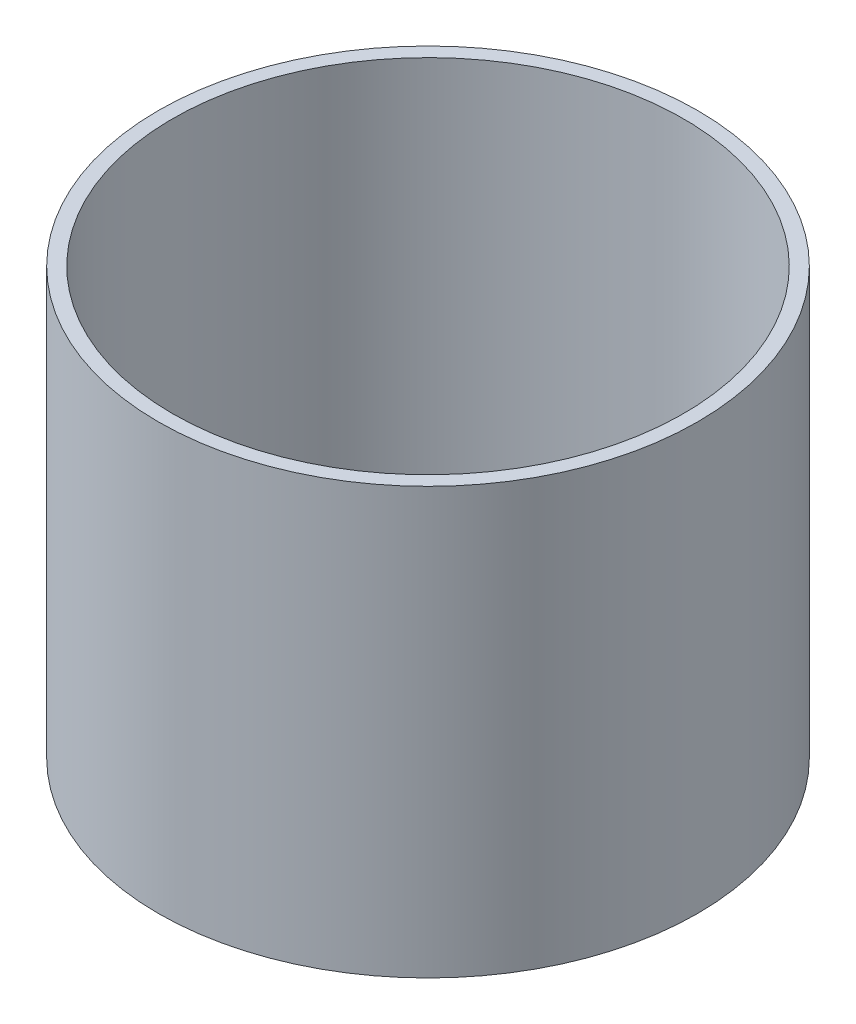
ISO-10303-21;
HEADER;
FILE_DESCRIPTION(('STEP AP214'),'2;1');
FILE_NAME('part.step','',(''),(''),'','','');
FILE_SCHEMA(('AUTOMOTIVE_DESIGN { 1 0 10303 214 1 1 1 1 }'));
ENDSEC;
DATA;
#1=APPLICATION_CONTEXT('core data for automotive mechanical design processes');
#2=APPLICATION_PROTOCOL_DEFINITION('international standard','automotive_design',2000,#1);
#3=PRODUCT_CONTEXT('',#1,'mechanical');
#4=PRODUCT('Part','Part','',(#3));
#5=PRODUCT_RELATED_PRODUCT_CATEGORY('part','',(#4));
#6=PRODUCT_DEFINITION_FORMATION('','',#4);
#7=PRODUCT_DEFINITION_CONTEXT('part definition',#1,'design');
#8=PRODUCT_DEFINITION('design','',#6,#7);
#9=PRODUCT_DEFINITION_SHAPE('','',#8);
#10=(LENGTH_UNIT() NAMED_UNIT(*) SI_UNIT(.MILLI.,.METRE.));
#11=(NAMED_UNIT(*) PLANE_ANGLE_UNIT() SI_UNIT($,.RADIAN.));
#12=(NAMED_UNIT(*) SI_UNIT($,.STERADIAN.) SOLID_ANGLE_UNIT());
#13=UNCERTAINTY_MEASURE_WITH_UNIT(LENGTH_MEASURE(1.E-05),#10,'distance_accuracy_value','');
#14=(GEOMETRIC_REPRESENTATION_CONTEXT(3) GLOBAL_UNCERTAINTY_ASSIGNED_CONTEXT((#13)) GLOBAL_UNIT_ASSIGNED_CONTEXT((#10,
#11,#12)) REPRESENTATION_CONTEXT('',''));
#15=CARTESIAN_POINT('',(0.,0.,0.));
#16=DIRECTION('',(0.,0.,1.));
#17=DIRECTION('',(1.,0.,0.));
#18=AXIS2_PLACEMENT_3D('',#15,#16,#17);
#19=CARTESIAN_POINT('',(0.,150.,0.));
#20=DIRECTION('',(0.,1.,0.));
#21=DIRECTION('',(0.,0.,1.));
#22=AXIS2_PLACEMENT_3D('',#19,#20,#21);
#23=PLANE('',#22);
#24=CARTESIAN_POINT('',(0.,150.,0.));
#25=DIRECTION('',(0.,1.,0.));
#26=DIRECTION('',(0.,0.,1.));
#27=AXIS2_PLACEMENT_3D('',#24,#25,#26);
#28=CIRCLE('',#27,95.);
#29=CARTESIAN_POINT('',(0.,150.,95.));
#30=VERTEX_POINT('',#29);
#31=EDGE_CURVE('E10',#30,#30,#28,.T.);
#32=ORIENTED_EDGE('',*,*,#31,.T.);
#33=EDGE_LOOP('',(#32));
#34=FACE_BOUND('',#33,.T.);
#35=CARTESIAN_POINT('',(0.,150.,0.));
#36=DIRECTION('',(0.,1.,0.));
#37=DIRECTION('',(0.,0.,1.));
#38=AXIS2_PLACEMENT_3D('',#35,#36,#37);
#39=CIRCLE('',#38,90.);
#40=CARTESIAN_POINT('',(0.,150.,90.));
#41=VERTEX_POINT('',#40);
#42=EDGE_CURVE('E42',#41,#41,#39,.T.);
#43=ORIENTED_EDGE('',*,*,#42,.F.);
#44=EDGE_LOOP('',(#43));
#45=FACE_BOUND('',#44,.T.);
#46=ADVANCED_FACE('F31',(#34,#45),#23,.T.);
#47=CARTESIAN_POINT('',(0.,0.,0.));
#48=DIRECTION('',(0.,1.,0.));
#49=DIRECTION('',(0.,0.,1.));
#50=AXIS2_PLACEMENT_3D('',#47,#48,#49);
#51=PLANE('',#50);
#52=CARTESIAN_POINT('',(0.,0.,0.));
#53=DIRECTION('',(0.,1.,0.));
#54=DIRECTION('',(0.,0.,1.));
#55=AXIS2_PLACEMENT_3D('',#52,#53,#54);
#56=CIRCLE('',#55,95.);
#57=CARTESIAN_POINT('',(0.,0.,95.));
#58=VERTEX_POINT('',#57);
#59=EDGE_CURVE('E35',#58,#58,#56,.T.);
#60=ORIENTED_EDGE('',*,*,#59,.F.);
#61=EDGE_LOOP('',(#60));
#62=FACE_BOUND('',#61,.T.);
#63=CARTESIAN_POINT('',(0.,0.,0.));
#64=DIRECTION('',(0.,1.,0.));
#65=DIRECTION('',(0.,0.,1.));
#66=AXIS2_PLACEMENT_3D('',#63,#64,#65);
#67=CIRCLE('',#66,90.);
#68=CARTESIAN_POINT('',(0.,0.,90.));
#69=VERTEX_POINT('',#68);
#70=EDGE_CURVE('E44',#69,#69,#67,.T.);
#71=ORIENTED_EDGE('',*,*,#70,.T.);
#72=EDGE_LOOP('',(#71));
#73=FACE_BOUND('',#72,.T.);
#74=ADVANCED_FACE('F54',(#62,#73),#51,.F.);
#75=CARTESIAN_POINT('',(0.,150.,0.));
#76=DIRECTION('',(0.,-1.,0.));
#77=DIRECTION('',(0.,0.,-1.));
#78=AXIS2_PLACEMENT_3D('',#75,#76,#77);
#79=CYLINDRICAL_SURFACE('',#78,95.);
#80=ORIENTED_EDGE('',*,*,#31,.F.);
#81=EDGE_LOOP('',(#80));
#82=FACE_BOUND('',#81,.T.);
#83=ORIENTED_EDGE('',*,*,#59,.T.);
#84=EDGE_LOOP('',(#83));
#85=FACE_BOUND('',#84,.T.);
#86=ADVANCED_FACE('F33',(#82,#85),#79,.T.);
#87=CARTESIAN_POINT('',(0.,150.,0.));
#88=DIRECTION('',(0.,-1.,0.));
#89=DIRECTION('',(0.,0.,-1.));
#90=AXIS2_PLACEMENT_3D('',#87,#88,#89);
#91=CYLINDRICAL_SURFACE('',#90,90.);
#92=ORIENTED_EDGE('',*,*,#42,.T.);
#93=EDGE_LOOP('',(#92));
#94=FACE_BOUND('',#93,.T.);
#95=ORIENTED_EDGE('',*,*,#70,.F.);
#96=EDGE_LOOP('',(#95));
#97=FACE_BOUND('',#96,.T.);
#98=ADVANCED_FACE('F50',(#94,#97),#91,.F.);
#99=CLOSED_SHELL('',(#46,#74,#86,#98));
#100=MANIFOLD_SOLID_BREP('B2',#99);
#101=ADVANCED_BREP_SHAPE_REPRESENTATION('',(#18,#100),#14);
#102=SHAPE_DEFINITION_REPRESENTATION(#9,#101);
ENDSEC;
END-ISO-10303-21;
